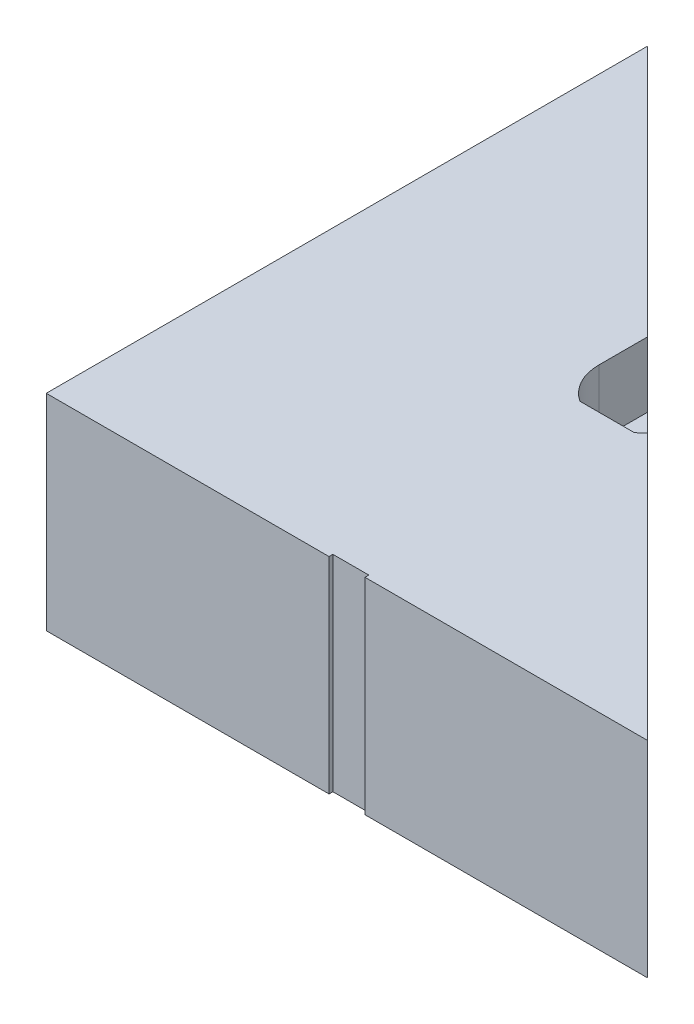
ISO-10303-21;
HEADER;
FILE_DESCRIPTION(('STEP AP214'),'2;1');
FILE_NAME('part.step','',(''),(''),'','','');
FILE_SCHEMA(('AUTOMOTIVE_DESIGN { 1 0 10303 214 1 1 1 1 }'));
ENDSEC;
DATA;
#1=APPLICATION_CONTEXT('core data for automotive mechanical design processes');
#2=APPLICATION_PROTOCOL_DEFINITION('international standard','automotive_design',2000,#1);
#3=PRODUCT_CONTEXT('',#1,'mechanical');
#4=PRODUCT('Part','Part','',(#3));
#5=PRODUCT_RELATED_PRODUCT_CATEGORY('part','',(#4));
#6=PRODUCT_DEFINITION_FORMATION('','',#4);
#7=PRODUCT_DEFINITION_CONTEXT('part definition',#1,'design');
#8=PRODUCT_DEFINITION('design','',#6,#7);
#9=PRODUCT_DEFINITION_SHAPE('','',#8);
#10=(LENGTH_UNIT() NAMED_UNIT(*) SI_UNIT(.MILLI.,.METRE.));
#11=(NAMED_UNIT(*) PLANE_ANGLE_UNIT() SI_UNIT($,.RADIAN.));
#12=(NAMED_UNIT(*) SI_UNIT($,.STERADIAN.) SOLID_ANGLE_UNIT());
#13=UNCERTAINTY_MEASURE_WITH_UNIT(LENGTH_MEASURE(1.E-05),#10,'distance_accuracy_value','');
#14=(GEOMETRIC_REPRESENTATION_CONTEXT(3) GLOBAL_UNCERTAINTY_ASSIGNED_CONTEXT((#13)) GLOBAL_UNIT_ASSIGNED_CONTEXT((#10,
#11,#12)) REPRESENTATION_CONTEXT('',''));
#15=CARTESIAN_POINT('',(0.,0.,0.));
#16=DIRECTION('',(0.,0.,1.));
#17=DIRECTION('',(1.,0.,0.));
#18=AXIS2_PLACEMENT_3D('',#15,#16,#17);
#19=CARTESIAN_POINT('',(0.,40.,0.));
#20=DIRECTION('',(0.,0.,-1.));
#21=DIRECTION('',(-1.,0.,0.));
#22=AXIS2_PLACEMENT_3D('',#19,#20,#21);
#23=PLANE('',#22);
#24=DIRECTION('',(1.,0.,0.));
#25=VECTOR('',#24,1.);
#26=CARTESIAN_POINT('',(0.,0.,0.));
#27=LINE('',#26,#25);
#28=CARTESIAN_POINT('',(0.,0.,0.));
#29=VERTEX_POINT('',#28);
#30=CARTESIAN_POINT('',(55.,0.,0.));
#31=VERTEX_POINT('',#30);
#32=EDGE_CURVE('E245',#29,#31,#27,.T.);
#33=ORIENTED_EDGE('',*,*,#32,.T.);
#34=DIRECTION('',(0.,1.,0.));
#35=VECTOR('',#34,1.);
#36=CARTESIAN_POINT('',(55.,40.,0.));
#37=LINE('',#36,#35);
#38=CARTESIAN_POINT('',(55.,40.,0.));
#39=VERTEX_POINT('',#38);
#40=EDGE_CURVE('E175',#31,#39,#37,.T.);
#41=ORIENTED_EDGE('',*,*,#40,.T.);
#42=DIRECTION('',(1.,0.,0.));
#43=VECTOR('',#42,1.);
#44=CARTESIAN_POINT('',(0.,40.,0.));
#45=LINE('',#44,#43);
#46=CARTESIAN_POINT('',(0.,40.,0.));
#47=VERTEX_POINT('',#46);
#48=EDGE_CURVE('E151',#47,#39,#45,.T.);
#49=ORIENTED_EDGE('',*,*,#48,.F.);
#50=DIRECTION('',(0.,-1.,0.));
#51=VECTOR('',#50,1.);
#52=CARTESIAN_POINT('',(0.,40.,0.));
#53=LINE('',#52,#51);
#54=EDGE_CURVE('E159',#47,#29,#53,.T.);
#55=ORIENTED_EDGE('',*,*,#54,.T.);
#56=EDGE_LOOP('',(#33,#41,#49,#55));
#57=FACE_BOUND('',#56,.T.);
#58=ADVANCED_FACE('F39',(#57),#23,.F.);
#59=CARTESIAN_POINT('',(0.,40.,0.));
#60=DIRECTION('',(1.,0.,0.));
#61=DIRECTION('',(0.,0.,-1.));
#62=AXIS2_PLACEMENT_3D('',#59,#60,#61);
#63=PLANE('',#62);
#64=DIRECTION('',(0.,0.,1.));
#65=VECTOR('',#64,1.);
#66=CARTESIAN_POINT('',(0.,0.,0.));
#67=LINE('',#66,#65);
#68=CARTESIAN_POINT('',(0.,0.,-117.));
#69=VERTEX_POINT('',#68);
#70=EDGE_CURVE('E236',#69,#29,#67,.T.);
#71=ORIENTED_EDGE('',*,*,#70,.T.);
#72=ORIENTED_EDGE('',*,*,#54,.F.);
#73=DIRECTION('',(0.,0.,1.));
#74=VECTOR('',#73,1.);
#75=CARTESIAN_POINT('',(0.,40.,0.));
#76=LINE('',#75,#74);
#77=CARTESIAN_POINT('',(0.,40.,-117.));
#78=VERTEX_POINT('',#77);
#79=EDGE_CURVE('E152',#78,#47,#76,.T.);
#80=ORIENTED_EDGE('',*,*,#79,.F.);
#81=DIRECTION('',(0.,-1.,0.));
#82=VECTOR('',#81,1.);
#83=CARTESIAN_POINT('',(0.,40.,-117.));
#84=LINE('',#83,#82);
#85=EDGE_CURVE('E160',#78,#69,#84,.T.);
#86=ORIENTED_EDGE('',*,*,#85,.T.);
#87=EDGE_LOOP('',(#71,#72,#80,#86));
#88=FACE_BOUND('',#87,.T.);
#89=ADVANCED_FACE('F41',(#88),#63,.F.);
#90=CARTESIAN_POINT('',(62.,40.,0.));
#91=VERTEX_POINT('',#90);
#92=CARTESIAN_POINT('',(117.,40.,0.));
#93=VERTEX_POINT('',#92);
#94=EDGE_CURVE('E143',#91,#93,#45,.T.);
#95=ORIENTED_EDGE('',*,*,#94,.F.);
#96=DIRECTION('',(0.,-1.,0.));
#97=VECTOR('',#96,1.);
#98=CARTESIAN_POINT('',(62.,40.,0.));
#99=LINE('',#98,#97);
#100=CARTESIAN_POINT('',(62.,0.,0.));
#101=VERTEX_POINT('',#100);
#102=EDGE_CURVE('E195',#91,#101,#99,.T.);
#103=ORIENTED_EDGE('',*,*,#102,.T.);
#104=CARTESIAN_POINT('',(117.,0.,0.));
#105=VERTEX_POINT('',#104);
#106=EDGE_CURVE('E157',#101,#105,#27,.T.);
#107=ORIENTED_EDGE('',*,*,#106,.T.);
#108=DIRECTION('',(0.,-1.,0.));
#109=VECTOR('',#108,1.);
#110=CARTESIAN_POINT('',(117.,40.,0.));
#111=LINE('',#110,#109);
#112=EDGE_CURVE('E131',#93,#105,#111,.T.);
#113=ORIENTED_EDGE('',*,*,#112,.F.);
#114=EDGE_LOOP('',(#95,#103,#107,#113));
#115=FACE_BOUND('',#114,.T.);
#116=ADVANCED_FACE('F155',(#115),#23,.F.);
#117=CARTESIAN_POINT('',(0.,40.,0.));
#118=DIRECTION('',(0.,-1.,0.));
#119=DIRECTION('',(0.,0.,-1.));
#120=AXIS2_PLACEMENT_3D('',#117,#118,#119);
#121=PLANE('',#120);
#122=ORIENTED_EDGE('',*,*,#94,.T.);
#123=DIRECTION('',(-0.707106781186548,0.,-0.707106781186548));
#124=VECTOR('',#123,1.);
#125=CARTESIAN_POINT('',(0.,40.,-117.));
#126=LINE('',#125,#124);
#127=CARTESIAN_POINT('',(65.2351920908019,40.,-51.7648079091981));
#128=VERTEX_POINT('',#127);
#129=EDGE_CURVE('E127',#93,#128,#126,.T.);
#130=ORIENTED_EDGE('',*,*,#129,.T.);
#131=CARTESIAN_POINT('',(58.5,40.,-58.5));
#132=DIRECTION('',(0.,1.,0.));
#133=DIRECTION('',(0.,0.,1.));
#134=AXIS2_PLACEMENT_3D('',#131,#132,#133);
#135=CIRCLE('',#134,9.52500000000002);
#136=CARTESIAN_POINT('',(63.7651418546892,40.,-50.5625));
#137=VERTEX_POINT('',#136);
#138=EDGE_CURVE('E227',#137,#128,#135,.T.);
#139=ORIENTED_EDGE('',*,*,#138,.F.);
#140=DIRECTION('',(1.,0.,0.));
#141=VECTOR('',#140,1.);
#142=CARTESIAN_POINT('',(0.,40.,-50.5625));
#143=LINE('',#142,#141);
#144=CARTESIAN_POINT('',(53.2348581453108,40.,-50.5625));
#145=VERTEX_POINT('',#144);
#146=EDGE_CURVE('E223',#145,#137,#143,.T.);
#147=ORIENTED_EDGE('',*,*,#146,.F.);
#148=CARTESIAN_POINT('',(58.5,40.,-58.5));
#149=DIRECTION('',(0.,1.,0.));
#150=DIRECTION('',(0.,0.,1.));
#151=AXIS2_PLACEMENT_3D('',#148,#149,#150);
#152=CIRCLE('',#151,9.52500000000002);
#153=CARTESIAN_POINT('',(48.975,40.,-58.5));
#154=VERTEX_POINT('',#153);
#155=EDGE_CURVE('E202',#154,#145,#152,.T.);
#156=ORIENTED_EDGE('',*,*,#155,.F.);
#157=DIRECTION('',(0.,0.,-1.));
#158=VECTOR('',#157,1.);
#159=CARTESIAN_POINT('',(48.975,40.,0.));
#160=LINE('',#159,#158);
#161=CARTESIAN_POINT('',(48.975,40.,-68.025));
#162=VERTEX_POINT('',#161);
#163=EDGE_CURVE('E208',#154,#162,#160,.T.);
#164=ORIENTED_EDGE('',*,*,#163,.T.);
#165=EDGE_CURVE('E139',#162,#78,#126,.T.);
#166=ORIENTED_EDGE('',*,*,#165,.T.);
#167=ORIENTED_EDGE('',*,*,#79,.T.);
#168=ORIENTED_EDGE('',*,*,#48,.T.);
#169=DIRECTION('',(0.,0.,-1.));
#170=VECTOR('',#169,1.);
#171=CARTESIAN_POINT('',(55.,40.,-0.750000000000001));
#172=LINE('',#171,#170);
#173=CARTESIAN_POINT('',(55.,40.,-0.750000000000001));
#174=VERTEX_POINT('',#173);
#175=EDGE_CURVE('E186',#39,#174,#172,.T.);
#176=ORIENTED_EDGE('',*,*,#175,.T.);
#177=DIRECTION('',(1.,0.,0.));
#178=VECTOR('',#177,1.);
#179=CARTESIAN_POINT('',(62.,40.,-0.750000000000001));
#180=LINE('',#179,#178);
#181=CARTESIAN_POINT('',(62.,40.,-0.750000000000001));
#182=VERTEX_POINT('',#181);
#183=EDGE_CURVE('E256',#174,#182,#180,.T.);
#184=ORIENTED_EDGE('',*,*,#183,.T.);
#185=DIRECTION('',(0.,0.,1.));
#186=VECTOR('',#185,1.);
#187=CARTESIAN_POINT('',(62.,40.,-0.750000000000001));
#188=LINE('',#187,#186);
#189=EDGE_CURVE('E147',#182,#91,#188,.T.);
#190=ORIENTED_EDGE('',*,*,#189,.T.);
#191=EDGE_LOOP('',(#122,#130,#139,#147,#156,#164,#166,#167,#168,#176,#184,#190));
#192=FACE_BOUND('',#191,.T.);
#193=ADVANCED_FACE('F144',(#192),#121,.F.);
#194=CARTESIAN_POINT('',(0.,0.,0.));
#195=DIRECTION('',(0.,-1.,0.));
#196=DIRECTION('',(0.,0.,-1.));
#197=AXIS2_PLACEMENT_3D('',#194,#195,#196);
#198=PLANE('',#197);
#199=DIRECTION('',(-0.707106781186548,0.,-0.707106781186548));
#200=VECTOR('',#199,1.);
#201=CARTESIAN_POINT('',(0.,0.,-117.));
#202=LINE('',#201,#200);
#203=EDGE_CURVE('E263',#105,#69,#202,.T.);
#204=ORIENTED_EDGE('',*,*,#203,.F.);
#205=ORIENTED_EDGE('',*,*,#106,.F.);
#206=DIRECTION('',(0.,0.,1.));
#207=VECTOR('',#206,1.);
#208=CARTESIAN_POINT('',(62.,0.,-0.750000000000001));
#209=LINE('',#208,#207);
#210=CARTESIAN_POINT('',(62.,0.,-0.750000000000001));
#211=VERTEX_POINT('',#210);
#212=EDGE_CURVE('E181',#211,#101,#209,.T.);
#213=ORIENTED_EDGE('',*,*,#212,.F.);
#214=DIRECTION('',(1.,0.,0.));
#215=VECTOR('',#214,1.);
#216=CARTESIAN_POINT('',(62.,0.,-0.750000000000001));
#217=LINE('',#216,#215);
#218=CARTESIAN_POINT('',(55.,0.,-0.750000000000001));
#219=VERTEX_POINT('',#218);
#220=EDGE_CURVE('E179',#219,#211,#217,.T.);
#221=ORIENTED_EDGE('',*,*,#220,.F.);
#222=DIRECTION('',(0.,0.,-1.));
#223=VECTOR('',#222,1.);
#224=CARTESIAN_POINT('',(55.,0.,0.));
#225=LINE('',#224,#223);
#226=EDGE_CURVE('E48',#31,#219,#225,.T.);
#227=ORIENTED_EDGE('',*,*,#226,.F.);
#228=ORIENTED_EDGE('',*,*,#32,.F.);
#229=ORIENTED_EDGE('',*,*,#70,.F.);
#230=EDGE_LOOP('',(#204,#205,#213,#221,#227,#228,#229));
#231=FACE_BOUND('',#230,.T.);
#232=ADVANCED_FACE('F180',(#231),#198,.T.);
#233=CARTESIAN_POINT('',(58.5,27.3,-58.5));
#234=DIRECTION('',(0.,1.,0.));
#235=DIRECTION('',(0.,0.,1.));
#236=AXIS2_PLACEMENT_3D('',#233,#234,#235);
#237=CYLINDRICAL_SURFACE('',#236,9.52500000000002);
#238=ORIENTED_EDGE('',*,*,#155,.T.);
#239=DIRECTION('',(0.,1.,0.));
#240=VECTOR('',#239,1.);
#241=CARTESIAN_POINT('',(53.2348581453108,27.3,-50.5625));
#242=LINE('',#241,#240);
#243=CARTESIAN_POINT('',(53.2348581453108,27.3,-50.5625));
#244=VERTEX_POINT('',#243);
#245=EDGE_CURVE('E220',#244,#145,#242,.T.);
#246=ORIENTED_EDGE('',*,*,#245,.F.);
#247=CARTESIAN_POINT('',(58.5,27.3,-58.5));
#248=DIRECTION('',(0.,1.,0.));
#249=DIRECTION('',(0.,0.,1.));
#250=AXIS2_PLACEMENT_3D('',#247,#248,#249);
#251=CIRCLE('',#250,9.52500000000002);
#252=CARTESIAN_POINT('',(48.975,27.3,-58.5));
#253=VERTEX_POINT('',#252);
#254=EDGE_CURVE('E203',#253,#244,#251,.T.);
#255=ORIENTED_EDGE('',*,*,#254,.F.);
#256=DIRECTION('',(0.,1.,0.));
#257=VECTOR('',#256,1.);
#258=CARTESIAN_POINT('',(48.975,27.3,-58.5));
#259=LINE('',#258,#257);
#260=EDGE_CURVE('E233',#253,#154,#259,.T.);
#261=ORIENTED_EDGE('',*,*,#260,.T.);
#262=EDGE_LOOP('',(#238,#246,#255,#261));
#263=FACE_BOUND('',#262,.T.);
#264=ADVANCED_FACE('F286',(#263),#237,.F.);
#265=CARTESIAN_POINT('',(48.975,27.3,0.));
#266=DIRECTION('',(1.,0.,0.));
#267=DIRECTION('',(0.,0.,-1.));
#268=AXIS2_PLACEMENT_3D('',#265,#266,#267);
#269=PLANE('',#268);
#270=DIRECTION('',(0.,-1.,0.));
#271=VECTOR('',#270,1.);
#272=CARTESIAN_POINT('',(48.975,27.3,-68.025));
#273=LINE('',#272,#271);
#274=CARTESIAN_POINT('',(48.975,27.3,-68.025));
#275=VERTEX_POINT('',#274);
#276=EDGE_CURVE('E54',#162,#275,#273,.T.);
#277=ORIENTED_EDGE('',*,*,#276,.F.);
#278=ORIENTED_EDGE('',*,*,#163,.F.);
#279=ORIENTED_EDGE('',*,*,#260,.F.);
#280=DIRECTION('',(0.,0.,-1.));
#281=VECTOR('',#280,1.);
#282=CARTESIAN_POINT('',(48.975,27.3,0.));
#283=LINE('',#282,#281);
#284=EDGE_CURVE('E216',#253,#275,#283,.T.);
#285=ORIENTED_EDGE('',*,*,#284,.T.);
#286=EDGE_LOOP('',(#277,#278,#279,#285));
#287=FACE_BOUND('',#286,.T.);
#288=ADVANCED_FACE('F290',(#287),#269,.T.);
#289=CARTESIAN_POINT('',(58.5,27.3,-58.5));
#290=DIRECTION('',(0.,1.,0.));
#291=DIRECTION('',(0.,0.,1.));
#292=AXIS2_PLACEMENT_3D('',#289,#290,#291);
#293=CYLINDRICAL_SURFACE('',#292,9.52500000000002);
#294=ORIENTED_EDGE('',*,*,#138,.T.);
#295=DIRECTION('',(0.,1.,0.));
#296=VECTOR('',#295,1.);
#297=CARTESIAN_POINT('',(65.2351920908019,27.3,-51.7648079091981));
#298=LINE('',#297,#296);
#299=CARTESIAN_POINT('',(65.2351920908019,27.3,-51.7648079091981));
#300=VERTEX_POINT('',#299);
#301=EDGE_CURVE('E134',#128,#300,#298,.F.);
#302=ORIENTED_EDGE('',*,*,#301,.T.);
#303=CARTESIAN_POINT('',(58.5,27.3,-58.5));
#304=DIRECTION('',(0.,1.,0.));
#305=DIRECTION('',(0.,0.,1.));
#306=AXIS2_PLACEMENT_3D('',#303,#304,#305);
#307=CIRCLE('',#306,9.52500000000002);
#308=CARTESIAN_POINT('',(63.7651418546892,27.3,-50.5625));
#309=VERTEX_POINT('',#308);
#310=EDGE_CURVE('E212',#309,#300,#307,.T.);
#311=ORIENTED_EDGE('',*,*,#310,.F.);
#312=DIRECTION('',(0.,1.,0.));
#313=VECTOR('',#312,1.);
#314=CARTESIAN_POINT('',(63.7651418546892,27.3,-50.5625));
#315=LINE('',#314,#313);
#316=EDGE_CURVE('E237',#309,#137,#315,.T.);
#317=ORIENTED_EDGE('',*,*,#316,.T.);
#318=EDGE_LOOP('',(#294,#302,#311,#317));
#319=FACE_BOUND('',#318,.T.);
#320=ADVANCED_FACE('F296',(#319),#293,.F.);
#321=CARTESIAN_POINT('',(0.,27.3,-50.5625));
#322=DIRECTION('',(0.,0.,1.));
#323=DIRECTION('',(1.,0.,0.));
#324=AXIS2_PLACEMENT_3D('',#321,#322,#323);
#325=PLANE('',#324);
#326=ORIENTED_EDGE('',*,*,#146,.T.);
#327=ORIENTED_EDGE('',*,*,#316,.F.);
#328=DIRECTION('',(1.,0.,0.));
#329=VECTOR('',#328,1.);
#330=CARTESIAN_POINT('',(0.,27.3,-50.5625));
#331=LINE('',#330,#329);
#332=EDGE_CURVE('E207',#244,#309,#331,.T.);
#333=ORIENTED_EDGE('',*,*,#332,.F.);
#334=ORIENTED_EDGE('',*,*,#245,.T.);
#335=EDGE_LOOP('',(#326,#327,#333,#334));
#336=FACE_BOUND('',#335,.T.);
#337=ADVANCED_FACE('F292',(#336),#325,.F.);
#338=CARTESIAN_POINT('',(0.,27.3,0.));
#339=DIRECTION('',(0.,1.,0.));
#340=DIRECTION('',(0.,0.,1.));
#341=AXIS2_PLACEMENT_3D('',#338,#339,#340);
#342=PLANE('',#341);
#343=DIRECTION('',(0.707106781186548,0.,0.707106781186548));
#344=VECTOR('',#343,1.);
#345=CARTESIAN_POINT('',(58.5,27.3,-58.5));
#346=LINE('',#345,#344);
#347=EDGE_CURVE('E11',#275,#300,#346,.T.);
#348=ORIENTED_EDGE('',*,*,#347,.F.);
#349=ORIENTED_EDGE('',*,*,#284,.F.);
#350=ORIENTED_EDGE('',*,*,#254,.T.);
#351=ORIENTED_EDGE('',*,*,#332,.T.);
#352=ORIENTED_EDGE('',*,*,#310,.T.);
#353=EDGE_LOOP('',(#348,#349,#350,#351,#352));
#354=FACE_BOUND('',#353,.T.);
#355=ADVANCED_FACE('F295',(#354),#342,.T.);
#356=CARTESIAN_POINT('',(55.,40.,-0.750000000000001));
#357=DIRECTION('',(-1.,0.,0.));
#358=DIRECTION('',(0.,0.,1.));
#359=AXIS2_PLACEMENT_3D('',#356,#357,#358);
#360=PLANE('',#359);
#361=ORIENTED_EDGE('',*,*,#226,.T.);
#362=DIRECTION('',(0.,-1.,0.));
#363=VECTOR('',#362,1.);
#364=CARTESIAN_POINT('',(55.,40.,-0.750000000000001));
#365=LINE('',#364,#363);
#366=EDGE_CURVE('E62',#174,#219,#365,.T.);
#367=ORIENTED_EDGE('',*,*,#366,.F.);
#368=ORIENTED_EDGE('',*,*,#175,.F.);
#369=ORIENTED_EDGE('',*,*,#40,.F.);
#370=EDGE_LOOP('',(#361,#367,#368,#369));
#371=FACE_BOUND('',#370,.T.);
#372=ADVANCED_FACE('F173',(#371),#360,.F.);
#373=CARTESIAN_POINT('',(62.,40.,-0.750000000000001));
#374=DIRECTION('',(1.,0.,0.));
#375=DIRECTION('',(0.,0.,-1.));
#376=AXIS2_PLACEMENT_3D('',#373,#374,#375);
#377=PLANE('',#376);
#378=ORIENTED_EDGE('',*,*,#189,.F.);
#379=DIRECTION('',(0.,-1.,0.));
#380=VECTOR('',#379,1.);
#381=CARTESIAN_POINT('',(62.,40.,-0.750000000000001));
#382=LINE('',#381,#380);
#383=EDGE_CURVE('E192',#182,#211,#382,.T.);
#384=ORIENTED_EDGE('',*,*,#383,.T.);
#385=ORIENTED_EDGE('',*,*,#212,.T.);
#386=ORIENTED_EDGE('',*,*,#102,.F.);
#387=EDGE_LOOP('',(#378,#384,#385,#386));
#388=FACE_BOUND('',#387,.T.);
#389=ADVANCED_FACE('F309',(#388),#377,.F.);
#390=CARTESIAN_POINT('',(62.,40.,-0.750000000000001));
#391=DIRECTION('',(0.,0.,-1.));
#392=DIRECTION('',(-1.,0.,0.));
#393=AXIS2_PLACEMENT_3D('',#390,#391,#392);
#394=PLANE('',#393);
#395=ORIENTED_EDGE('',*,*,#220,.T.);
#396=ORIENTED_EDGE('',*,*,#383,.F.);
#397=ORIENTED_EDGE('',*,*,#183,.F.);
#398=ORIENTED_EDGE('',*,*,#366,.T.);
#399=EDGE_LOOP('',(#395,#396,#397,#398));
#400=FACE_BOUND('',#399,.T.);
#401=ADVANCED_FACE('F310',(#400),#394,.F.);
#402=CARTESIAN_POINT('',(0.,40.,-117.));
#403=DIRECTION('',(-0.707106781186548,0.,0.707106781186548));
#404=DIRECTION('',(0.707106781186548,0.,0.707106781186548));
#405=AXIS2_PLACEMENT_3D('',#402,#403,#404);
#406=PLANE('',#405);
#407=ORIENTED_EDGE('',*,*,#276,.T.);
#408=ORIENTED_EDGE('',*,*,#347,.T.);
#409=ORIENTED_EDGE('',*,*,#301,.F.);
#410=ORIENTED_EDGE('',*,*,#129,.F.);
#411=ORIENTED_EDGE('',*,*,#112,.T.);
#412=ORIENTED_EDGE('',*,*,#203,.T.);
#413=ORIENTED_EDGE('',*,*,#85,.F.);
#414=ORIENTED_EDGE('',*,*,#165,.F.);
#415=EDGE_LOOP('',(#407,#408,#409,#410,#411,#412,#413,#414));
#416=FACE_BOUND('',#415,.T.);
#417=ADVANCED_FACE('F129',(#416),#406,.F.);
#418=CLOSED_SHELL('',(#58,#89,#116,#193,#232,#264,#288,#320,#337,#355,#372,#389,#401,#417));
#419=MANIFOLD_SOLID_BREP('B2',#418);
#420=ADVANCED_BREP_SHAPE_REPRESENTATION('',(#18,#419),#14);
#421=SHAPE_DEFINITION_REPRESENTATION(#9,#420);
ENDSEC;
END-ISO-10303-21;
